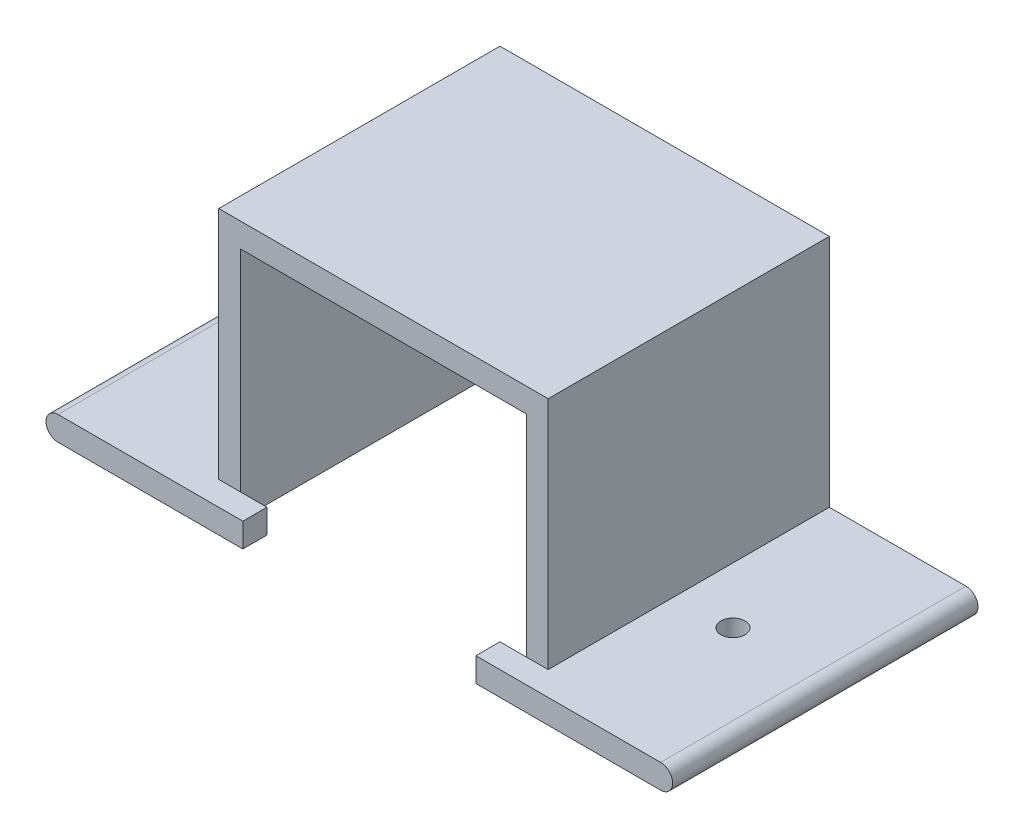
ISO-10303-21;
HEADER;
FILE_DESCRIPTION(('STEP AP214'),'2;1');
FILE_NAME('part.step','',(''),(''),'','','');
FILE_SCHEMA(('AUTOMOTIVE_DESIGN { 1 0 10303 214 1 1 1 1 }'));
ENDSEC;
DATA;
#1=APPLICATION_CONTEXT('core data for automotive mechanical design processes');
#2=APPLICATION_PROTOCOL_DEFINITION('international standard','automotive_design',2000,#1);
#3=PRODUCT_CONTEXT('',#1,'mechanical');
#4=PRODUCT('Part','Part','',(#3));
#5=PRODUCT_RELATED_PRODUCT_CATEGORY('part','',(#4));
#6=PRODUCT_DEFINITION_FORMATION('','',#4);
#7=PRODUCT_DEFINITION_CONTEXT('part definition',#1,'design');
#8=PRODUCT_DEFINITION('design','',#6,#7);
#9=PRODUCT_DEFINITION_SHAPE('','',#8);
#10=(LENGTH_UNIT() NAMED_UNIT(*) SI_UNIT(.MILLI.,.METRE.));
#11=(NAMED_UNIT(*) PLANE_ANGLE_UNIT() SI_UNIT($,.RADIAN.));
#12=(NAMED_UNIT(*) SI_UNIT($,.STERADIAN.) SOLID_ANGLE_UNIT());
#13=UNCERTAINTY_MEASURE_WITH_UNIT(LENGTH_MEASURE(1.E-05),#10,'distance_accuracy_value','');
#14=(GEOMETRIC_REPRESENTATION_CONTEXT(3) GLOBAL_UNCERTAINTY_ASSIGNED_CONTEXT((#13)) GLOBAL_UNIT_ASSIGNED_CONTEXT((#10,
#11,#12)) REPRESENTATION_CONTEXT('',''));
#15=CARTESIAN_POINT('',(0.,0.,0.));
#16=DIRECTION('',(0.,0.,1.));
#17=DIRECTION('',(1.,0.,0.));
#18=AXIS2_PLACEMENT_3D('',#15,#16,#17);
#19=CARTESIAN_POINT('',(0.,1.5,32.));
#20=DIRECTION('',(0.,0.,1.));
#21=DIRECTION('',(1.,0.,0.));
#22=AXIS2_PLACEMENT_3D('',#19,#20,#21);
#23=PLANE('',#22);
#24=DIRECTION('',(0.,-1.,0.));
#25=VECTOR('',#24,1.);
#26=CARTESIAN_POINT('',(-58.,32.2,32.));
#27=LINE('',#26,#25);
#28=CARTESIAN_POINT('',(-58.,32.2,32.));
#29=VERTEX_POINT('',#28);
#30=CARTESIAN_POINT('',(-58.,3.,32.));
#31=VERTEX_POINT('',#30);
#32=EDGE_CURVE('E103',#29,#31,#27,.T.);
#33=ORIENTED_EDGE('',*,*,#32,.T.);
#34=DIRECTION('',(1.,0.,0.));
#35=VECTOR('',#34,1.);
#36=CARTESIAN_POINT('',(0.,3.00000000000001,32.));
#37=LINE('',#36,#35);
#38=CARTESIAN_POINT('',(-55.3,3.,32.));
#39=VERTEX_POINT('',#38);
#40=EDGE_CURVE('E11',#31,#39,#37,.T.);
#41=ORIENTED_EDGE('',*,*,#40,.T.);
#42=DIRECTION('',(0.,1.,0.));
#43=VECTOR('',#42,1.);
#44=CARTESIAN_POINT('',(-55.3,29.2,32.));
#45=LINE('',#44,#43);
#46=CARTESIAN_POINT('',(-55.3,29.2,32.));
#47=VERTEX_POINT('',#46);
#48=EDGE_CURVE('E93',#39,#47,#45,.T.);
#49=ORIENTED_EDGE('',*,*,#48,.T.);
#50=DIRECTION('',(1.,0.,0.));
#51=VECTOR('',#50,1.);
#52=CARTESIAN_POINT('',(-55.,29.2,32.));
#53=LINE('',#52,#51);
#54=CARTESIAN_POINT('',(-19.7,29.2,32.));
#55=VERTEX_POINT('',#54);
#56=EDGE_CURVE('E98',#47,#55,#53,.T.);
#57=ORIENTED_EDGE('',*,*,#56,.T.);
#58=DIRECTION('',(0.,-1.,0.));
#59=VECTOR('',#58,1.);
#60=CARTESIAN_POINT('',(-19.7,29.2,32.));
#61=LINE('',#60,#59);
#62=CARTESIAN_POINT('',(-19.7,3.,32.));
#63=VERTEX_POINT('',#62);
#64=EDGE_CURVE('E119',#55,#63,#61,.T.);
#65=ORIENTED_EDGE('',*,*,#64,.T.);
#66=DIRECTION('',(-1.,0.,0.));
#67=VECTOR('',#66,1.);
#68=CARTESIAN_POINT('',(-23.,3.,32.));
#69=LINE('',#68,#67);
#70=CARTESIAN_POINT('',(-17.,3.,32.));
#71=VERTEX_POINT('',#70);
#72=EDGE_CURVE('E43',#71,#63,#69,.T.);
#73=ORIENTED_EDGE('',*,*,#72,.F.);
#74=DIRECTION('',(0.,1.,0.));
#75=VECTOR('',#74,1.);
#76=CARTESIAN_POINT('',(-17.,3.,32.));
#77=LINE('',#76,#75);
#78=CARTESIAN_POINT('',(-17.,32.2,32.));
#79=VERTEX_POINT('',#78);
#80=EDGE_CURVE('E128',#71,#79,#77,.T.);
#81=ORIENTED_EDGE('',*,*,#80,.T.);
#82=DIRECTION('',(-1.,0.,0.));
#83=VECTOR('',#82,1.);
#84=CARTESIAN_POINT('',(-17.,32.2,32.));
#85=LINE('',#84,#83);
#86=EDGE_CURVE('E239',#79,#29,#85,.T.);
#87=ORIENTED_EDGE('',*,*,#86,.T.);
#88=EDGE_LOOP('',(#33,#41,#49,#57,#65,#73,#81,#87));
#89=FACE_BOUND('',#88,.T.);
#90=ADVANCED_FACE('F35',(#89),#23,.T.);
#91=CARTESIAN_POINT('',(0.,1.5,32.));
#92=DIRECTION('',(0.,0.,-1.));
#93=DIRECTION('',(-1.,0.,0.));
#94=AXIS2_PLACEMENT_3D('',#91,#92,#93);
#95=CYLINDRICAL_SURFACE('',#94,1.5);
#96=DIRECTION('',(0.,0.,-1.));
#97=VECTOR('',#96,1.);
#98=CARTESIAN_POINT('',(0.,0.,32.));
#99=LINE('',#98,#97);
#100=CARTESIAN_POINT('',(0.,0.,35.));
#101=VERTEX_POINT('',#100);
#102=CARTESIAN_POINT('',(0.,0.,-3.));
#103=VERTEX_POINT('',#102);
#104=EDGE_CURVE('E123',#101,#103,#99,.T.);
#105=ORIENTED_EDGE('',*,*,#104,.T.);
#106=CARTESIAN_POINT('',(0.,1.5,-3.));
#107=DIRECTION('',(0.,0.,-1.));
#108=DIRECTION('',(-1.,0.,0.));
#109=AXIS2_PLACEMENT_3D('',#106,#107,#108);
#110=CIRCLE('',#109,1.5);
#111=CARTESIAN_POINT('',(0.,3.,-3.));
#112=VERTEX_POINT('',#111);
#113=EDGE_CURVE('E125',#112,#103,#110,.T.);
#114=ORIENTED_EDGE('',*,*,#113,.F.);
#115=DIRECTION('',(0.,0.,-1.));
#116=VECTOR('',#115,1.);
#117=CARTESIAN_POINT('',(0.,3.,32.));
#118=LINE('',#117,#116);
#119=CARTESIAN_POINT('',(0.,3.,35.));
#120=VERTEX_POINT('',#119);
#121=EDGE_CURVE('E151',#120,#112,#118,.T.);
#122=ORIENTED_EDGE('',*,*,#121,.F.);
#123=CARTESIAN_POINT('',(0.,1.5,35.));
#124=DIRECTION('',(0.,0.,1.));
#125=DIRECTION('',(1.,0.,0.));
#126=AXIS2_PLACEMENT_3D('',#123,#124,#125);
#127=CIRCLE('',#126,1.5);
#128=EDGE_CURVE('E191',#101,#120,#127,.T.);
#129=ORIENTED_EDGE('',*,*,#128,.F.);
#130=EDGE_LOOP('',(#105,#114,#122,#129));
#131=FACE_BOUND('',#130,.T.);
#132=ADVANCED_FACE('F37',(#131),#95,.T.);
#133=CARTESIAN_POINT('',(0.,3.,32.));
#134=DIRECTION('',(0.,-1.,0.));
#135=DIRECTION('',(0.,0.,-1.));
#136=AXIS2_PLACEMENT_3D('',#133,#134,#135);
#137=PLANE('',#136);
#138=CARTESIAN_POINT('',(-10.,3.,16.));
#139=DIRECTION('',(0.,-1.,0.));
#140=DIRECTION('',(0.,0.,-1.));
#141=AXIS2_PLACEMENT_3D('',#138,#139,#140);
#142=CIRCLE('',#141,1.5);
#143=CARTESIAN_POINT('',(-10.,3.,14.5));
#144=VERTEX_POINT('',#143);
#145=EDGE_CURVE('E298',#144,#144,#142,.T.);
#146=ORIENTED_EDGE('',*,*,#145,.T.);
#147=EDGE_LOOP('',(#146));
#148=FACE_BOUND('',#147,.T.);
#149=ORIENTED_EDGE('',*,*,#121,.T.);
#150=DIRECTION('',(1.,0.,0.));
#151=VECTOR('',#150,1.);
#152=CARTESIAN_POINT('',(0.,3.,-3.));
#153=LINE('',#152,#151);
#154=CARTESIAN_POINT('',(-17.,3.,-3.));
#155=VERTEX_POINT('',#154);
#156=EDGE_CURVE('E233',#155,#112,#153,.T.);
#157=ORIENTED_EDGE('',*,*,#156,.F.);
#158=DIRECTION('',(0.,0.,-1.));
#159=VECTOR('',#158,1.);
#160=CARTESIAN_POINT('',(-17.,3.,32.));
#161=LINE('',#160,#159);
#162=EDGE_CURVE('E149',#71,#155,#161,.T.);
#163=ORIENTED_EDGE('',*,*,#162,.F.);
#164=ORIENTED_EDGE('',*,*,#72,.T.);
#165=CARTESIAN_POINT('',(-23.,3.,32.));
#166=VERTEX_POINT('',#165);
#167=EDGE_CURVE('E161',#63,#166,#69,.T.);
#168=ORIENTED_EDGE('',*,*,#167,.T.);
#169=DIRECTION('',(0.,0.,-1.));
#170=VECTOR('',#169,1.);
#171=CARTESIAN_POINT('',(-23.,3.,35.));
#172=LINE('',#171,#170);
#173=CARTESIAN_POINT('',(-23.,3.,35.));
#174=VERTEX_POINT('',#173);
#175=EDGE_CURVE('E204',#174,#166,#172,.T.);
#176=ORIENTED_EDGE('',*,*,#175,.F.);
#177=DIRECTION('',(-1.,0.,0.));
#178=VECTOR('',#177,1.);
#179=CARTESIAN_POINT('',(-20.,3.,35.));
#180=LINE('',#179,#178);
#181=EDGE_CURVE('E194',#120,#174,#180,.T.);
#182=ORIENTED_EDGE('',*,*,#181,.F.);
#183=EDGE_LOOP('',(#149,#157,#163,#164,#168,#176,#182));
#184=FACE_BOUND('',#183,.T.);
#185=ADVANCED_FACE('F341',(#148,#184),#137,.F.);
#186=CARTESIAN_POINT('',(-17.,30.2,32.));
#187=DIRECTION('',(-1.,0.,0.));
#188=DIRECTION('',(0.,0.,1.));
#189=AXIS2_PLACEMENT_3D('',#186,#187,#188);
#190=PLANE('',#189);
#191=ORIENTED_EDGE('',*,*,#162,.T.);
#192=DIRECTION('',(0.,-1.,0.));
#193=VECTOR('',#192,1.);
#194=CARTESIAN_POINT('',(-17.,0.,-3.));
#195=LINE('',#194,#193);
#196=CARTESIAN_POINT('',(-17.,32.2,-3.));
#197=VERTEX_POINT('',#196);
#198=EDGE_CURVE('E230',#197,#155,#195,.T.);
#199=ORIENTED_EDGE('',*,*,#198,.F.);
#200=DIRECTION('',(0.,0.,-1.));
#201=VECTOR('',#200,1.);
#202=CARTESIAN_POINT('',(-17.,32.2,32.));
#203=LINE('',#202,#201);
#204=EDGE_CURVE('E146',#79,#197,#203,.T.);
#205=ORIENTED_EDGE('',*,*,#204,.F.);
#206=ORIENTED_EDGE('',*,*,#80,.F.);
#207=EDGE_LOOP('',(#191,#199,#205,#206));
#208=FACE_BOUND('',#207,.T.);
#209=ADVANCED_FACE('F344',(#208),#190,.F.);
#210=CARTESIAN_POINT('',(-17.,32.2,32.));
#211=DIRECTION('',(0.,-1.,0.));
#212=DIRECTION('',(0.,0.,-1.));
#213=AXIS2_PLACEMENT_3D('',#210,#211,#212);
#214=PLANE('',#213);
#215=ORIENTED_EDGE('',*,*,#204,.T.);
#216=DIRECTION('',(1.,0.,0.));
#217=VECTOR('',#216,1.);
#218=CARTESIAN_POINT('',(0.,32.2,-3.));
#219=LINE('',#218,#217);
#220=CARTESIAN_POINT('',(-58.,32.2,-3.));
#221=VERTEX_POINT('',#220);
#222=EDGE_CURVE('E227',#221,#197,#219,.T.);
#223=ORIENTED_EDGE('',*,*,#222,.F.);
#224=DIRECTION('',(0.,0.,-1.));
#225=VECTOR('',#224,1.);
#226=CARTESIAN_POINT('',(-58.,32.2,32.));
#227=LINE('',#226,#225);
#228=EDGE_CURVE('E143',#29,#221,#227,.T.);
#229=ORIENTED_EDGE('',*,*,#228,.F.);
#230=ORIENTED_EDGE('',*,*,#86,.F.);
#231=EDGE_LOOP('',(#215,#223,#229,#230));
#232=FACE_BOUND('',#231,.T.);
#233=ADVANCED_FACE('F346',(#232),#214,.F.);
#234=CARTESIAN_POINT('',(-58.,30.2,32.));
#235=DIRECTION('',(1.,0.,0.));
#236=DIRECTION('',(0.,0.,-1.));
#237=AXIS2_PLACEMENT_3D('',#234,#235,#236);
#238=PLANE('',#237);
#239=ORIENTED_EDGE('',*,*,#228,.T.);
#240=DIRECTION('',(0.,1.,0.));
#241=VECTOR('',#240,1.);
#242=CARTESIAN_POINT('',(-58.,0.,-3.));
#243=LINE('',#242,#241);
#244=CARTESIAN_POINT('',(-58.,3.00000000000001,-3.));
#245=VERTEX_POINT('',#244);
#246=EDGE_CURVE('E224',#245,#221,#243,.T.);
#247=ORIENTED_EDGE('',*,*,#246,.F.);
#248=DIRECTION('',(0.,0.,-1.));
#249=VECTOR('',#248,1.);
#250=CARTESIAN_POINT('',(-58.,3.,32.));
#251=LINE('',#250,#249);
#252=EDGE_CURVE('E140',#31,#245,#251,.T.);
#253=ORIENTED_EDGE('',*,*,#252,.F.);
#254=ORIENTED_EDGE('',*,*,#32,.F.);
#255=EDGE_LOOP('',(#239,#247,#253,#254));
#256=FACE_BOUND('',#255,.T.);
#257=ADVANCED_FACE('F250',(#256),#238,.F.);
#258=CARTESIAN_POINT('',(-58.,3.,32.));
#259=DIRECTION('',(0.,-1.,0.));
#260=DIRECTION('',(0.,0.,-1.));
#261=AXIS2_PLACEMENT_3D('',#258,#259,#260);
#262=PLANE('',#261);
#263=CARTESIAN_POINT('',(-65.,3.,16.));
#264=DIRECTION('',(0.,-1.,0.));
#265=DIRECTION('',(0.,0.,-1.));
#266=AXIS2_PLACEMENT_3D('',#263,#264,#265);
#267=CIRCLE('',#266,1.5);
#268=CARTESIAN_POINT('',(-65.,3.,14.5));
#269=VERTEX_POINT('',#268);
#270=EDGE_CURVE('E294',#269,#269,#267,.T.);
#271=ORIENTED_EDGE('',*,*,#270,.T.);
#272=EDGE_LOOP('',(#271));
#273=FACE_BOUND('',#272,.T.);
#274=ORIENTED_EDGE('',*,*,#252,.T.);
#275=DIRECTION('',(1.,0.,0.));
#276=VECTOR('',#275,1.);
#277=CARTESIAN_POINT('',(0.,3.,-3.));
#278=LINE('',#277,#276);
#279=CARTESIAN_POINT('',(-75.,3.,-3.));
#280=VERTEX_POINT('',#279);
#281=EDGE_CURVE('E221',#280,#245,#278,.T.);
#282=ORIENTED_EDGE('',*,*,#281,.F.);
#283=DIRECTION('',(0.,0.,-1.));
#284=VECTOR('',#283,1.);
#285=CARTESIAN_POINT('',(-75.,3.,32.));
#286=LINE('',#285,#284);
#287=CARTESIAN_POINT('',(-75.,3.,35.));
#288=VERTEX_POINT('',#287);
#289=EDGE_CURVE('E137',#288,#280,#286,.T.);
#290=ORIENTED_EDGE('',*,*,#289,.F.);
#291=DIRECTION('',(-1.,0.,0.));
#292=VECTOR('',#291,1.);
#293=CARTESIAN_POINT('',(-52.,3.,35.));
#294=LINE('',#293,#292);
#295=CARTESIAN_POINT('',(-52.,3.,35.));
#296=VERTEX_POINT('',#295);
#297=EDGE_CURVE('E184',#296,#288,#294,.T.);
#298=ORIENTED_EDGE('',*,*,#297,.F.);
#299=DIRECTION('',(0.,0.,-1.));
#300=VECTOR('',#299,1.);
#301=CARTESIAN_POINT('',(-52.,3.,35.));
#302=LINE('',#301,#300);
#303=CARTESIAN_POINT('',(-52.,3.,32.));
#304=VERTEX_POINT('',#303);
#305=EDGE_CURVE('E176',#296,#304,#302,.T.);
#306=ORIENTED_EDGE('',*,*,#305,.T.);
#307=DIRECTION('',(-1.,0.,0.));
#308=VECTOR('',#307,1.);
#309=CARTESIAN_POINT('',(-55.,3.,32.));
#310=LINE('',#309,#308);
#311=EDGE_CURVE('E50',#304,#39,#310,.T.);
#312=ORIENTED_EDGE('',*,*,#311,.T.);
#313=ORIENTED_EDGE('',*,*,#40,.F.);
#314=EDGE_LOOP('',(#274,#282,#290,#298,#306,#312,#313));
#315=FACE_BOUND('',#314,.T.);
#316=ADVANCED_FACE('F253',(#273,#315),#262,.F.);
#317=CARTESIAN_POINT('',(-75.,1.5,32.));
#318=DIRECTION('',(0.,0.,-1.));
#319=DIRECTION('',(-1.,0.,0.));
#320=AXIS2_PLACEMENT_3D('',#317,#318,#319);
#321=CYLINDRICAL_SURFACE('',#320,1.5);
#322=ORIENTED_EDGE('',*,*,#289,.T.);
#323=CARTESIAN_POINT('',(-75.,1.5,-3.));
#324=DIRECTION('',(0.,0.,-1.));
#325=DIRECTION('',(-1.,0.,0.));
#326=AXIS2_PLACEMENT_3D('',#323,#324,#325);
#327=CIRCLE('',#326,1.5);
#328=CARTESIAN_POINT('',(-75.,0.,-3.));
#329=VERTEX_POINT('',#328);
#330=EDGE_CURVE('E218',#329,#280,#327,.T.);
#331=ORIENTED_EDGE('',*,*,#330,.F.);
#332=DIRECTION('',(0.,0.,-1.));
#333=VECTOR('',#332,1.);
#334=CARTESIAN_POINT('',(-75.,0.,32.));
#335=LINE('',#334,#333);
#336=CARTESIAN_POINT('',(-75.,0.,35.));
#337=VERTEX_POINT('',#336);
#338=EDGE_CURVE('E134',#337,#329,#335,.T.);
#339=ORIENTED_EDGE('',*,*,#338,.F.);
#340=CARTESIAN_POINT('',(-75.,1.5,35.));
#341=DIRECTION('',(0.,0.,1.));
#342=DIRECTION('',(-1.,0.,0.));
#343=AXIS2_PLACEMENT_3D('',#340,#341,#342);
#344=CIRCLE('',#343,1.5);
#345=EDGE_CURVE('E302',#288,#337,#344,.T.);
#346=ORIENTED_EDGE('',*,*,#345,.F.);
#347=EDGE_LOOP('',(#322,#331,#339,#346));
#348=FACE_BOUND('',#347,.T.);
#349=ADVANCED_FACE('F267',(#348),#321,.T.);
#350=CARTESIAN_POINT('',(-55.3,29.2,32.));
#351=DIRECTION('',(-1.,0.,0.));
#352=DIRECTION('',(0.,0.,1.));
#353=AXIS2_PLACEMENT_3D('',#350,#351,#352);
#354=PLANE('',#353);
#355=DIRECTION('',(0.,1.,0.));
#356=VECTOR('',#355,1.);
#357=CARTESIAN_POINT('',(-55.3,29.2,0.));
#358=LINE('',#357,#356);
#359=CARTESIAN_POINT('',(-55.3,0.,0.));
#360=VERTEX_POINT('',#359);
#361=CARTESIAN_POINT('',(-55.3,29.2,0.));
#362=VERTEX_POINT('',#361);
#363=EDGE_CURVE('E109',#360,#362,#358,.T.);
#364=ORIENTED_EDGE('',*,*,#363,.T.);
#365=DIRECTION('',(0.,0.,-1.));
#366=VECTOR('',#365,1.);
#367=CARTESIAN_POINT('',(-55.3,29.2,32.));
#368=LINE('',#367,#366);
#369=EDGE_CURVE('E106',#47,#362,#368,.T.);
#370=ORIENTED_EDGE('',*,*,#369,.F.);
#371=ORIENTED_EDGE('',*,*,#48,.F.);
#372=CARTESIAN_POINT('',(-55.3,0.,32.));
#373=VERTEX_POINT('',#372);
#374=EDGE_CURVE('E102',#373,#39,#45,.T.);
#375=ORIENTED_EDGE('',*,*,#374,.F.);
#376=DIRECTION('',(0.,0.,-1.));
#377=VECTOR('',#376,1.);
#378=CARTESIAN_POINT('',(-55.3,0.,32.));
#379=LINE('',#378,#377);
#380=EDGE_CURVE('E111',#373,#360,#379,.T.);
#381=ORIENTED_EDGE('',*,*,#380,.T.);
#382=EDGE_LOOP('',(#364,#370,#371,#375,#381));
#383=FACE_BOUND('',#382,.T.);
#384=ADVANCED_FACE('F107',(#383),#354,.F.);
#385=CARTESIAN_POINT('',(-20.,29.2,32.));
#386=DIRECTION('',(0.,1.,0.));
#387=DIRECTION('',(0.,0.,1.));
#388=AXIS2_PLACEMENT_3D('',#385,#386,#387);
#389=PLANE('',#388);
#390=DIRECTION('',(1.,0.,0.));
#391=VECTOR('',#390,1.);
#392=CARTESIAN_POINT('',(-20.,29.2,0.));
#393=LINE('',#392,#391);
#394=CARTESIAN_POINT('',(-19.7,29.2,0.));
#395=VERTEX_POINT('',#394);
#396=EDGE_CURVE('E73',#362,#395,#393,.T.);
#397=ORIENTED_EDGE('',*,*,#396,.T.);
#398=DIRECTION('',(0.,0.,-1.));
#399=VECTOR('',#398,1.);
#400=CARTESIAN_POINT('',(-19.7,29.2,32.));
#401=LINE('',#400,#399);
#402=EDGE_CURVE('E112',#55,#395,#401,.T.);
#403=ORIENTED_EDGE('',*,*,#402,.F.);
#404=ORIENTED_EDGE('',*,*,#56,.F.);
#405=ORIENTED_EDGE('',*,*,#369,.T.);
#406=EDGE_LOOP('',(#397,#403,#404,#405));
#407=FACE_BOUND('',#406,.T.);
#408=ADVANCED_FACE('F114',(#407),#389,.F.);
#409=CARTESIAN_POINT('',(-19.7,29.2,32.));
#410=DIRECTION('',(1.,0.,0.));
#411=DIRECTION('',(0.,0.,-1.));
#412=AXIS2_PLACEMENT_3D('',#409,#410,#411);
#413=PLANE('',#412);
#414=DIRECTION('',(0.,-1.,0.));
#415=VECTOR('',#414,1.);
#416=CARTESIAN_POINT('',(-19.7,29.2,0.));
#417=LINE('',#416,#415);
#418=CARTESIAN_POINT('',(-19.7,0.,0.));
#419=VERTEX_POINT('',#418);
#420=EDGE_CURVE('E81',#395,#419,#417,.T.);
#421=ORIENTED_EDGE('',*,*,#420,.T.);
#422=DIRECTION('',(0.,0.,-1.));
#423=VECTOR('',#422,1.);
#424=CARTESIAN_POINT('',(-19.7,0.,32.));
#425=LINE('',#424,#423);
#426=CARTESIAN_POINT('',(-19.7,0.,32.));
#427=VERTEX_POINT('',#426);
#428=EDGE_CURVE('E59',#427,#419,#425,.T.);
#429=ORIENTED_EDGE('',*,*,#428,.F.);
#430=EDGE_CURVE('E117',#63,#427,#61,.T.);
#431=ORIENTED_EDGE('',*,*,#430,.F.);
#432=ORIENTED_EDGE('',*,*,#64,.F.);
#433=ORIENTED_EDGE('',*,*,#402,.T.);
#434=EDGE_LOOP('',(#421,#429,#431,#432,#433));
#435=FACE_BOUND('',#434,.T.);
#436=ADVANCED_FACE('F338',(#435),#413,.F.);
#437=CARTESIAN_POINT('',(0.,0.,32.));
#438=DIRECTION('',(0.,1.,0.));
#439=DIRECTION('',(-1.,0.,0.));
#440=AXIS2_PLACEMENT_3D('',#437,#438,#439);
#441=PLANE('',#440);
#442=CARTESIAN_POINT('',(-65.,0.,16.));
#443=DIRECTION('',(0.,-1.,0.));
#444=DIRECTION('',(1.,0.,0.));
#445=AXIS2_PLACEMENT_3D('',#442,#443,#444);
#446=CIRCLE('',#445,1.5);
#447=CARTESIAN_POINT('',(-63.5,0.,16.));
#448=VERTEX_POINT('',#447);
#449=EDGE_CURVE('E396',#448,#448,#446,.T.);
#450=ORIENTED_EDGE('',*,*,#449,.F.);
#451=EDGE_LOOP('',(#450));
#452=FACE_BOUND('',#451,.T.);
#453=CARTESIAN_POINT('',(-10.,0.,16.));
#454=DIRECTION('',(0.,-1.,0.));
#455=DIRECTION('',(-1.,0.,0.));
#456=AXIS2_PLACEMENT_3D('',#453,#454,#455);
#457=CIRCLE('',#456,1.5);
#458=CARTESIAN_POINT('',(-11.5,0.,16.));
#459=VERTEX_POINT('',#458);
#460=EDGE_CURVE('E398',#459,#459,#457,.T.);
#461=ORIENTED_EDGE('',*,*,#460,.F.);
#462=EDGE_LOOP('',(#461));
#463=FACE_BOUND('',#462,.T.);
#464=ORIENTED_EDGE('',*,*,#428,.T.);
#465=DIRECTION('',(1.,0.,0.));
#466=VECTOR('',#465,1.);
#467=CARTESIAN_POINT('',(0.,0.,0.));
#468=LINE('',#467,#466);
#469=EDGE_CURVE('E211',#360,#419,#468,.T.);
#470=ORIENTED_EDGE('',*,*,#469,.F.);
#471=ORIENTED_EDGE('',*,*,#380,.F.);
#472=DIRECTION('',(1.,0.,0.));
#473=VECTOR('',#472,1.);
#474=CARTESIAN_POINT('',(-55.,0.,32.));
#475=LINE('',#474,#473);
#476=CARTESIAN_POINT('',(-52.,0.,32.));
#477=VERTEX_POINT('',#476);
#478=EDGE_CURVE('E292',#373,#477,#475,.T.);
#479=ORIENTED_EDGE('',*,*,#478,.T.);
#480=DIRECTION('',(0.,0.,-1.));
#481=VECTOR('',#480,1.);
#482=CARTESIAN_POINT('',(-52.,0.,35.));
#483=LINE('',#482,#481);
#484=CARTESIAN_POINT('',(-52.,0.,35.));
#485=VERTEX_POINT('',#484);
#486=EDGE_CURVE('E168',#485,#477,#483,.T.);
#487=ORIENTED_EDGE('',*,*,#486,.F.);
#488=DIRECTION('',(1.,0.,0.));
#489=VECTOR('',#488,1.);
#490=CARTESIAN_POINT('',(-55.,0.,35.));
#491=LINE('',#490,#489);
#492=EDGE_CURVE('E304',#337,#485,#491,.T.);
#493=ORIENTED_EDGE('',*,*,#492,.F.);
#494=ORIENTED_EDGE('',*,*,#338,.T.);
#495=DIRECTION('',(1.,0.,0.));
#496=VECTOR('',#495,1.);
#497=CARTESIAN_POINT('',(0.,0.,-3.));
#498=LINE('',#497,#496);
#499=EDGE_CURVE('E215',#329,#103,#498,.T.);
#500=ORIENTED_EDGE('',*,*,#499,.T.);
#501=ORIENTED_EDGE('',*,*,#104,.F.);
#502=DIRECTION('',(1.,0.,0.));
#503=VECTOR('',#502,1.);
#504=CARTESIAN_POINT('',(-20.,0.,35.));
#505=LINE('',#504,#503);
#506=CARTESIAN_POINT('',(-23.,0.,35.));
#507=VERTEX_POINT('',#506);
#508=EDGE_CURVE('E188',#507,#101,#505,.T.);
#509=ORIENTED_EDGE('',*,*,#508,.F.);
#510=DIRECTION('',(0.,0.,-1.));
#511=VECTOR('',#510,1.);
#512=CARTESIAN_POINT('',(-23.,0.,35.));
#513=LINE('',#512,#511);
#514=CARTESIAN_POINT('',(-23.,0.,32.));
#515=VERTEX_POINT('',#514);
#516=EDGE_CURVE('E198',#507,#515,#513,.T.);
#517=ORIENTED_EDGE('',*,*,#516,.T.);
#518=DIRECTION('',(1.,0.,0.));
#519=VECTOR('',#518,1.);
#520=CARTESIAN_POINT('',(-20.,0.,32.));
#521=LINE('',#520,#519);
#522=EDGE_CURVE('E174',#515,#427,#521,.T.);
#523=ORIENTED_EDGE('',*,*,#522,.T.);
#524=EDGE_LOOP('',(#464,#470,#471,#479,#487,#493,#494,#500,#501,#509,#517,#523));
#525=FACE_BOUND('',#524,.T.);
#526=ADVANCED_FACE('F285',(#452,#463,#525),#441,.F.);
#527=CARTESIAN_POINT('',(0.,0.,-3.));
#528=DIRECTION('',(0.,0.,-1.));
#529=DIRECTION('',(-1.,0.,0.));
#530=AXIS2_PLACEMENT_3D('',#527,#528,#529);
#531=PLANE('',#530);
#532=ORIENTED_EDGE('',*,*,#499,.F.);
#533=ORIENTED_EDGE('',*,*,#330,.T.);
#534=ORIENTED_EDGE('',*,*,#281,.T.);
#535=ORIENTED_EDGE('',*,*,#246,.T.);
#536=ORIENTED_EDGE('',*,*,#222,.T.);
#537=ORIENTED_EDGE('',*,*,#198,.T.);
#538=ORIENTED_EDGE('',*,*,#156,.T.);
#539=ORIENTED_EDGE('',*,*,#113,.T.);
#540=EDGE_LOOP('',(#532,#533,#534,#535,#536,#537,#538,#539));
#541=FACE_BOUND('',#540,.T.);
#542=ADVANCED_FACE('F260',(#541),#531,.T.);
#543=CARTESIAN_POINT('',(0.,0.,0.));
#544=DIRECTION('',(0.,0.,-1.));
#545=DIRECTION('',(-1.,0.,0.));
#546=AXIS2_PLACEMENT_3D('',#543,#544,#545);
#547=PLANE('',#546);
#548=ORIENTED_EDGE('',*,*,#420,.F.);
#549=ORIENTED_EDGE('',*,*,#396,.F.);
#550=ORIENTED_EDGE('',*,*,#363,.F.);
#551=ORIENTED_EDGE('',*,*,#469,.T.);
#552=EDGE_LOOP('',(#548,#549,#550,#551));
#553=FACE_BOUND('',#552,.T.);
#554=ADVANCED_FACE('F283',(#553),#547,.F.);
#555=CARTESIAN_POINT('',(0.,1.5,32.));
#556=DIRECTION('',(0.,0.,1.));
#557=DIRECTION('',(1.,0.,0.));
#558=AXIS2_PLACEMENT_3D('',#555,#556,#557);
#559=PLANE('',#558);
#560=ORIENTED_EDGE('',*,*,#167,.F.);
#561=ORIENTED_EDGE('',*,*,#430,.T.);
#562=ORIENTED_EDGE('',*,*,#522,.F.);
#563=DIRECTION('',(0.,-1.,0.));
#564=VECTOR('',#563,1.);
#565=CARTESIAN_POINT('',(-23.,0.,32.));
#566=LINE('',#565,#564);
#567=EDGE_CURVE('E167',#166,#515,#566,.T.);
#568=ORIENTED_EDGE('',*,*,#567,.F.);
#569=EDGE_LOOP('',(#560,#561,#562,#568));
#570=FACE_BOUND('',#569,.T.);
#571=ADVANCED_FACE('F337',(#570),#559,.F.);
#572=CARTESIAN_POINT('',(-23.,0.,35.));
#573=DIRECTION('',(1.,0.,0.));
#574=DIRECTION('',(0.,0.,-1.));
#575=AXIS2_PLACEMENT_3D('',#572,#573,#574);
#576=PLANE('',#575);
#577=ORIENTED_EDGE('',*,*,#567,.T.);
#578=ORIENTED_EDGE('',*,*,#516,.F.);
#579=DIRECTION('',(0.,-1.,0.));
#580=VECTOR('',#579,1.);
#581=CARTESIAN_POINT('',(-23.,0.,35.));
#582=LINE('',#581,#580);
#583=EDGE_CURVE('E196',#174,#507,#582,.T.);
#584=ORIENTED_EDGE('',*,*,#583,.F.);
#585=ORIENTED_EDGE('',*,*,#175,.T.);
#586=EDGE_LOOP('',(#577,#578,#584,#585));
#587=FACE_BOUND('',#586,.T.);
#588=ADVANCED_FACE('F335',(#587),#576,.F.);
#589=CARTESIAN_POINT('',(0.,1.5,35.));
#590=DIRECTION('',(0.,0.,1.));
#591=DIRECTION('',(1.,0.,0.));
#592=AXIS2_PLACEMENT_3D('',#589,#590,#591);
#593=PLANE('',#592);
#594=ORIENTED_EDGE('',*,*,#508,.T.);
#595=ORIENTED_EDGE('',*,*,#128,.T.);
#596=ORIENTED_EDGE('',*,*,#181,.T.);
#597=ORIENTED_EDGE('',*,*,#583,.T.);
#598=EDGE_LOOP('',(#594,#595,#596,#597));
#599=FACE_BOUND('',#598,.T.);
#600=ADVANCED_FACE('F350',(#599),#593,.T.);
#601=CARTESIAN_POINT('',(-75.,1.5,32.));
#602=DIRECTION('',(0.,0.,-1.));
#603=DIRECTION('',(-1.,0.,0.));
#604=AXIS2_PLACEMENT_3D('',#601,#602,#603);
#605=PLANE('',#604);
#606=ORIENTED_EDGE('',*,*,#374,.T.);
#607=ORIENTED_EDGE('',*,*,#311,.F.);
#608=DIRECTION('',(0.,1.,0.));
#609=VECTOR('',#608,1.);
#610=CARTESIAN_POINT('',(-52.,0.,32.));
#611=LINE('',#610,#609);
#612=EDGE_CURVE('E293',#477,#304,#611,.T.);
#613=ORIENTED_EDGE('',*,*,#612,.F.);
#614=ORIENTED_EDGE('',*,*,#478,.F.);
#615=EDGE_LOOP('',(#606,#607,#613,#614));
#616=FACE_BOUND('',#615,.T.);
#617=ADVANCED_FACE('F290',(#616),#605,.T.);
#618=CARTESIAN_POINT('',(-52.,0.,35.));
#619=DIRECTION('',(-1.,0.,0.));
#620=DIRECTION('',(0.,0.,1.));
#621=AXIS2_PLACEMENT_3D('',#618,#619,#620);
#622=PLANE('',#621);
#623=ORIENTED_EDGE('',*,*,#612,.T.);
#624=ORIENTED_EDGE('',*,*,#305,.F.);
#625=DIRECTION('',(0.,1.,0.));
#626=VECTOR('',#625,1.);
#627=CARTESIAN_POINT('',(-52.,0.,35.));
#628=LINE('',#627,#626);
#629=EDGE_CURVE('E309',#485,#296,#628,.T.);
#630=ORIENTED_EDGE('',*,*,#629,.F.);
#631=ORIENTED_EDGE('',*,*,#486,.T.);
#632=EDGE_LOOP('',(#623,#624,#630,#631));
#633=FACE_BOUND('',#632,.T.);
#634=ADVANCED_FACE('F357',(#633),#622,.F.);
#635=CARTESIAN_POINT('',(-75.,1.5,35.));
#636=DIRECTION('',(0.,0.,-1.));
#637=DIRECTION('',(-1.,0.,0.));
#638=AXIS2_PLACEMENT_3D('',#635,#636,#637);
#639=PLANE('',#638);
#640=ORIENTED_EDGE('',*,*,#345,.T.);
#641=ORIENTED_EDGE('',*,*,#492,.T.);
#642=ORIENTED_EDGE('',*,*,#629,.T.);
#643=ORIENTED_EDGE('',*,*,#297,.T.);
#644=EDGE_LOOP('',(#640,#641,#642,#643));
#645=FACE_BOUND('',#644,.T.);
#646=ADVANCED_FACE('F316',(#645),#639,.F.);
#647=CARTESIAN_POINT('',(-10.,4.,16.));
#648=DIRECTION('',(0.,-1.,0.));
#649=DIRECTION('',(1.,0.,0.));
#650=AXIS2_PLACEMENT_3D('',#647,#648,#649);
#651=CYLINDRICAL_SURFACE('',#650,1.5);
#652=ORIENTED_EDGE('',*,*,#460,.T.);
#653=EDGE_LOOP('',(#652));
#654=FACE_BOUND('',#653,.T.);
#655=ORIENTED_EDGE('',*,*,#145,.F.);
#656=EDGE_LOOP('',(#655));
#657=FACE_BOUND('',#656,.T.);
#658=ADVANCED_FACE('F404',(#654,#657),#651,.F.);
#659=CARTESIAN_POINT('',(-65.,3.99999999999999,16.));
#660=DIRECTION('',(0.,-1.,0.));
#661=DIRECTION('',(1.,0.,0.));
#662=AXIS2_PLACEMENT_3D('',#659,#660,#661);
#663=CYLINDRICAL_SURFACE('',#662,1.5);
#664=ORIENTED_EDGE('',*,*,#449,.T.);
#665=EDGE_LOOP('',(#664));
#666=FACE_BOUND('',#665,.T.);
#667=ORIENTED_EDGE('',*,*,#270,.F.);
#668=EDGE_LOOP('',(#667));
#669=FACE_BOUND('',#668,.T.);
#670=ADVANCED_FACE('F407',(#666,#669),#663,.F.);
#671=CLOSED_SHELL('',(#90,#132,#185,#209,#233,#257,#316,#349,#384,#408,#436,#526,#542,#554,#571,
#588,#600,#617,#634,#646,#658,#670));
#672=MANIFOLD_SOLID_BREP('B2',#671);
#673=ADVANCED_BREP_SHAPE_REPRESENTATION('',(#18,#672),#14);
#674=SHAPE_DEFINITION_REPRESENTATION(#9,#673);
ENDSEC;
END-ISO-10303-21;
